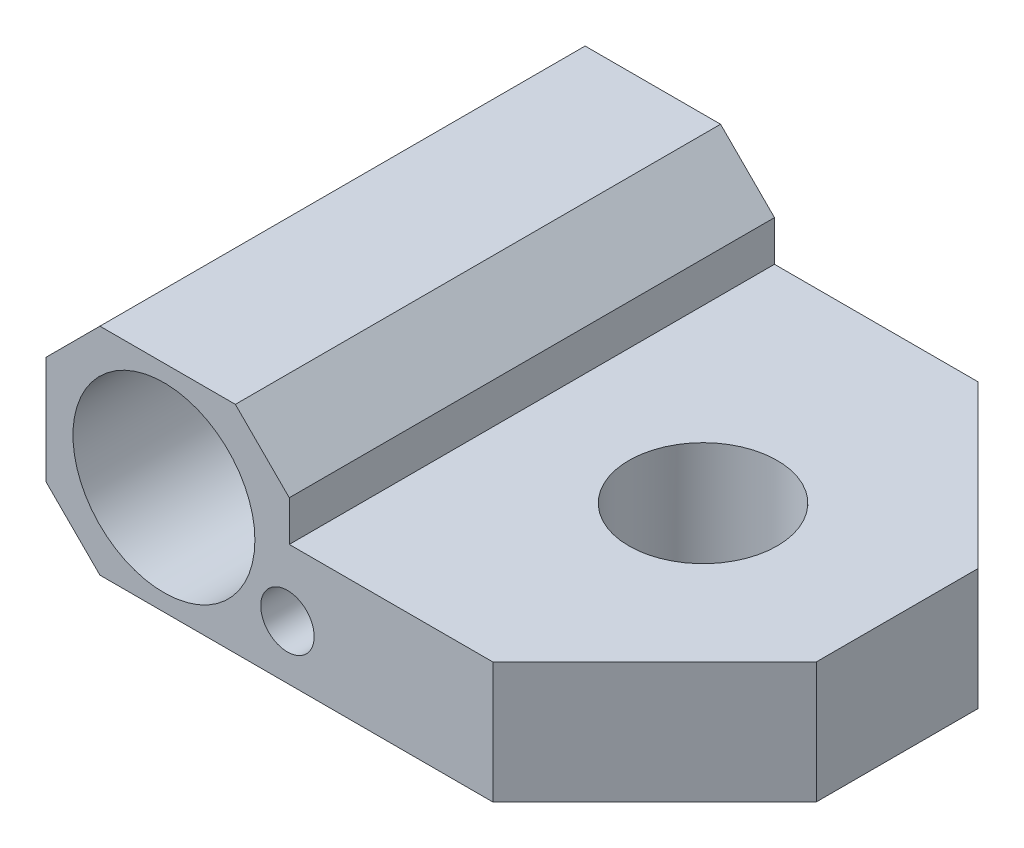
ISO-10303-21;
HEADER;
FILE_DESCRIPTION(('STEP AP214'),'2;1');
FILE_NAME('part.step','',(''),(''),'','','');
FILE_SCHEMA(('AUTOMOTIVE_DESIGN { 1 0 10303 214 1 1 1 1 }'));
ENDSEC;
DATA;
#1=APPLICATION_CONTEXT('core data for automotive mechanical design processes');
#2=APPLICATION_PROTOCOL_DEFINITION('international standard','automotive_design',2000,#1);
#3=PRODUCT_CONTEXT('',#1,'mechanical');
#4=PRODUCT('Part','Part','',(#3));
#5=PRODUCT_RELATED_PRODUCT_CATEGORY('part','',(#4));
#6=PRODUCT_DEFINITION_FORMATION('','',#4);
#7=PRODUCT_DEFINITION_CONTEXT('part definition',#1,'design');
#8=PRODUCT_DEFINITION('design','',#6,#7);
#9=PRODUCT_DEFINITION_SHAPE('','',#8);
#10=(LENGTH_UNIT() NAMED_UNIT(*) SI_UNIT(.MILLI.,.METRE.));
#11=(NAMED_UNIT(*) PLANE_ANGLE_UNIT() SI_UNIT($,.RADIAN.));
#12=(NAMED_UNIT(*) SI_UNIT($,.STERADIAN.) SOLID_ANGLE_UNIT());
#13=UNCERTAINTY_MEASURE_WITH_UNIT(LENGTH_MEASURE(1.E-05),#10,'distance_accuracy_value','');
#14=(GEOMETRIC_REPRESENTATION_CONTEXT(3) GLOBAL_UNCERTAINTY_ASSIGNED_CONTEXT((#13)) GLOBAL_UNIT_ASSIGNED_CONTEXT((#10,
#11,#12)) REPRESENTATION_CONTEXT('',''));
#15=CARTESIAN_POINT('',(0.,0.,0.));
#16=DIRECTION('',(0.,0.,1.));
#17=DIRECTION('',(1.,0.,0.));
#18=AXIS2_PLACEMENT_3D('',#15,#16,#17);
#19=CARTESIAN_POINT('',(-15.375,-4.,-9.));
#20=DIRECTION('',(-1.,0.,0.));
#21=DIRECTION('',(0.,0.,1.));
#22=AXIS2_PLACEMENT_3D('',#19,#20,#21);
#23=PLANE('',#22);
#24=DIRECTION('',(0.,1.,0.));
#25=VECTOR('',#24,1.);
#26=CARTESIAN_POINT('',(-15.375,-4.,-9.));
#27=LINE('',#26,#25);
#28=CARTESIAN_POINT('',(-15.375,-2.,-9.));
#29=VERTEX_POINT('',#28);
#30=CARTESIAN_POINT('',(-15.375,1.99999999999999,-9.));
#31=VERTEX_POINT('',#30);
#32=EDGE_CURVE('E151',#29,#31,#27,.T.);
#33=ORIENTED_EDGE('',*,*,#32,.F.);
#34=DIRECTION('',(0.,0.,1.));
#35=VECTOR('',#34,1.);
#36=CARTESIAN_POINT('',(-15.375,-2.,9.));
#37=LINE('',#36,#35);
#38=CARTESIAN_POINT('',(-15.375,-2.,9.));
#39=VERTEX_POINT('',#38);
#40=EDGE_CURVE('E161',#29,#39,#37,.T.);
#41=ORIENTED_EDGE('',*,*,#40,.T.);
#42=DIRECTION('',(0.,1.,0.));
#43=VECTOR('',#42,1.);
#44=CARTESIAN_POINT('',(-15.375,-4.,9.));
#45=LINE('',#44,#43);
#46=CARTESIAN_POINT('',(-15.375,1.99999999999999,9.));
#47=VERTEX_POINT('',#46);
#48=EDGE_CURVE('E145',#39,#47,#45,.T.);
#49=ORIENTED_EDGE('',*,*,#48,.T.);
#50=DIRECTION('',(0.,0.,-1.));
#51=VECTOR('',#50,1.);
#52=CARTESIAN_POINT('',(-15.375,1.99999999999999,-9.));
#53=LINE('',#52,#51);
#54=EDGE_CURVE('E153',#47,#31,#53,.T.);
#55=ORIENTED_EDGE('',*,*,#54,.T.);
#56=EDGE_LOOP('',(#33,#41,#49,#55));
#57=FACE_BOUND('',#56,.T.);
#58=ADVANCED_FACE('F32',(#57),#23,.T.);
#59=CARTESIAN_POINT('',(-15.375,-4.,-9.));
#60=DIRECTION('',(0.,0.,-1.));
#61=DIRECTION('',(-1.,0.,0.));
#62=AXIS2_PLACEMENT_3D('',#59,#60,#61);
#63=PLANE('',#62);
#64=DIRECTION('',(-1.,0.,0.));
#65=VECTOR('',#64,1.);
#66=CARTESIAN_POINT('',(-15.375,-4.,-9.));
#67=LINE('',#66,#65);
#68=CARTESIAN_POINT('',(1.2,-4.,-9.));
#69=VERTEX_POINT('',#68);
#70=CARTESIAN_POINT('',(-13.375,-4.,-9.));
#71=VERTEX_POINT('',#70);
#72=EDGE_CURVE('E141',#69,#71,#67,.T.);
#73=ORIENTED_EDGE('',*,*,#72,.T.);
#74=DIRECTION('',(-0.707106781186549,0.707106781186546,0.));
#75=VECTOR('',#74,1.);
#76=CARTESIAN_POINT('',(-14.375,-3.,-9.));
#77=LINE('',#76,#75);
#78=EDGE_CURVE('E174',#71,#29,#77,.T.);
#79=ORIENTED_EDGE('',*,*,#78,.T.);
#80=ORIENTED_EDGE('',*,*,#32,.T.);
#81=DIRECTION('',(-0.707106781186546,-0.707106781186549,0.));
#82=VECTOR('',#81,1.);
#83=CARTESIAN_POINT('',(-18.375,-1.00000000000002,-9.));
#84=LINE('',#83,#82);
#85=CARTESIAN_POINT('',(-13.375,4.,-9.));
#86=VERTEX_POINT('',#85);
#87=EDGE_CURVE('E53',#31,#86,#84,.F.);
#88=ORIENTED_EDGE('',*,*,#87,.T.);
#89=DIRECTION('',(-1.,0.,0.));
#90=VECTOR('',#89,1.);
#91=CARTESIAN_POINT('',(-15.375,4.,-9.));
#92=LINE('',#91,#90);
#93=CARTESIAN_POINT('',(-8.35000000000001,4.,-9.));
#94=VERTEX_POINT('',#93);
#95=EDGE_CURVE('E185',#94,#86,#92,.T.);
#96=ORIENTED_EDGE('',*,*,#95,.F.);
#97=DIRECTION('',(0.707106781186549,-0.707106781186546,0.));
#98=VECTOR('',#97,1.);
#99=CARTESIAN_POINT('',(-7.86250000000002,3.51250000000001,-9.));
#100=LINE('',#99,#98);
#101=CARTESIAN_POINT('',(-6.35,2.,-9.));
#102=VERTEX_POINT('',#101);
#103=EDGE_CURVE('E47',#94,#102,#100,.T.);
#104=ORIENTED_EDGE('',*,*,#103,.T.);
#105=DIRECTION('',(0.,-1.,0.));
#106=VECTOR('',#105,1.);
#107=CARTESIAN_POINT('',(-6.35,4.,-9.));
#108=LINE('',#107,#106);
#109=CARTESIAN_POINT('',(-6.35,0.499999999999998,-9.));
#110=VERTEX_POINT('',#109);
#111=EDGE_CURVE('E253',#102,#110,#108,.T.);
#112=ORIENTED_EDGE('',*,*,#111,.T.);
#113=DIRECTION('',(1.,0.,0.));
#114=VECTOR('',#113,1.);
#115=CARTESIAN_POINT('',(7.2,0.5,-9.));
#116=LINE('',#115,#114);
#117=CARTESIAN_POINT('',(1.2,0.499999999999999,-9.));
#118=VERTEX_POINT('',#117);
#119=EDGE_CURVE('E256',#110,#118,#116,.T.);
#120=ORIENTED_EDGE('',*,*,#119,.T.);
#121=DIRECTION('',(0.,1.,0.));
#122=VECTOR('',#121,1.);
#123=CARTESIAN_POINT('',(1.2,-4.,-9.));
#124=LINE('',#123,#122);
#125=EDGE_CURVE('E387',#69,#118,#124,.T.);
#126=ORIENTED_EDGE('',*,*,#125,.F.);
#127=EDGE_LOOP('',(#73,#79,#80,#88,#96,#104,#112,#120,#126));
#128=FACE_BOUND('',#127,.T.);
#129=CARTESIAN_POINT('',(-6.41742430504416,-2.,-9.));
#130=DIRECTION('',(0.,0.,1.));
#131=DIRECTION('',(1.,0.,0.));
#132=AXIS2_PLACEMENT_3D('',#129,#130,#131);
#133=CIRCLE('',#132,0.9905);
#134=CARTESIAN_POINT('',(-5.42692430504416,-2.,-9.));
#135=VERTEX_POINT('',#134);
#136=EDGE_CURVE('E264',#135,#135,#133,.T.);
#137=ORIENTED_EDGE('',*,*,#136,.T.);
#138=EDGE_LOOP('',(#137));
#139=FACE_BOUND('',#138,.T.);
#140=CARTESIAN_POINT('',(-11.,0.,-9.));
#141=DIRECTION('',(0.,0.,1.));
#142=DIRECTION('',(1.,0.,0.));
#143=AXIS2_PLACEMENT_3D('',#140,#141,#142);
#144=CIRCLE('',#143,3.375);
#145=CARTESIAN_POINT('',(-7.625,0.,-9.));
#146=VERTEX_POINT('',#145);
#147=EDGE_CURVE('E192',#146,#146,#144,.T.);
#148=ORIENTED_EDGE('',*,*,#147,.T.);
#149=EDGE_LOOP('',(#148));
#150=FACE_BOUND('',#149,.T.);
#151=ADVANCED_FACE('F215',(#128,#139,#150),#63,.T.);
#152=CARTESIAN_POINT('',(7.2,-4.,-9.));
#153=DIRECTION('',(1.,0.,0.));
#154=DIRECTION('',(0.,0.,-1.));
#155=AXIS2_PLACEMENT_3D('',#152,#153,#154);
#156=PLANE('',#155);
#157=DIRECTION('',(0.,1.,0.));
#158=VECTOR('',#157,1.);
#159=CARTESIAN_POINT('',(7.2,-4.,3.));
#160=LINE('',#159,#158);
#161=CARTESIAN_POINT('',(7.2,-4.,3.));
#162=VERTEX_POINT('',#161);
#163=CARTESIAN_POINT('',(7.2,0.5,3.));
#164=VERTEX_POINT('',#163);
#165=EDGE_CURVE('E119',#162,#164,#160,.T.);
#166=ORIENTED_EDGE('',*,*,#165,.F.);
#167=DIRECTION('',(0.,0.,-1.));
#168=VECTOR('',#167,1.);
#169=CARTESIAN_POINT('',(7.2,-4.,-9.));
#170=LINE('',#169,#168);
#171=CARTESIAN_POINT('',(7.2,-4.,-3.));
#172=VERTEX_POINT('',#171);
#173=EDGE_CURVE('E132',#162,#172,#170,.T.);
#174=ORIENTED_EDGE('',*,*,#173,.T.);
#175=DIRECTION('',(0.,1.,0.));
#176=VECTOR('',#175,1.);
#177=CARTESIAN_POINT('',(7.2,-4.,-3.));
#178=LINE('',#177,#176);
#179=CARTESIAN_POINT('',(7.2,0.499999999999999,-3.));
#180=VERTEX_POINT('',#179);
#181=EDGE_CURVE('E258',#172,#180,#178,.T.);
#182=ORIENTED_EDGE('',*,*,#181,.T.);
#183=DIRECTION('',(0.,0.,1.));
#184=VECTOR('',#183,1.);
#185=CARTESIAN_POINT('',(7.2,0.5,-9.));
#186=LINE('',#185,#184);
#187=EDGE_CURVE('E135',#180,#164,#186,.T.);
#188=ORIENTED_EDGE('',*,*,#187,.T.);
#189=EDGE_LOOP('',(#166,#174,#182,#188));
#190=FACE_BOUND('',#189,.T.);
#191=ADVANCED_FACE('F130',(#190),#156,.T.);
#192=CARTESIAN_POINT('',(-15.375,-4.,9.));
#193=DIRECTION('',(0.,0.,1.));
#194=DIRECTION('',(1.,0.,0.));
#195=AXIS2_PLACEMENT_3D('',#192,#193,#194);
#196=PLANE('',#195);
#197=ORIENTED_EDGE('',*,*,#48,.F.);
#198=DIRECTION('',(0.707106781186549,-0.707106781186546,0.));
#199=VECTOR('',#198,1.);
#200=CARTESIAN_POINT('',(-14.375,-3.,9.));
#201=LINE('',#200,#199);
#202=CARTESIAN_POINT('',(-13.375,-4.,9.));
#203=VERTEX_POINT('',#202);
#204=EDGE_CURVE('E168',#39,#203,#201,.T.);
#205=ORIENTED_EDGE('',*,*,#204,.T.);
#206=DIRECTION('',(1.,0.,0.));
#207=VECTOR('',#206,1.);
#208=CARTESIAN_POINT('',(-15.375,-4.,9.));
#209=LINE('',#208,#207);
#210=CARTESIAN_POINT('',(1.2,-4.,9.));
#211=VERTEX_POINT('',#210);
#212=EDGE_CURVE('E142',#203,#211,#209,.T.);
#213=ORIENTED_EDGE('',*,*,#212,.T.);
#214=DIRECTION('',(0.,1.,0.));
#215=VECTOR('',#214,1.);
#216=CARTESIAN_POINT('',(1.2,-4.,9.));
#217=LINE('',#216,#215);
#218=CARTESIAN_POINT('',(1.2,0.499999999999999,9.));
#219=VERTEX_POINT('',#218);
#220=EDGE_CURVE('E122',#211,#219,#217,.T.);
#221=ORIENTED_EDGE('',*,*,#220,.T.);
#222=DIRECTION('',(1.,0.,0.));
#223=VECTOR('',#222,1.);
#224=CARTESIAN_POINT('',(7.2,0.5,9.));
#225=LINE('',#224,#223);
#226=CARTESIAN_POINT('',(-6.35,0.499999999999998,9.));
#227=VERTEX_POINT('',#226);
#228=EDGE_CURVE('E243',#227,#219,#225,.T.);
#229=ORIENTED_EDGE('',*,*,#228,.F.);
#230=DIRECTION('',(0.,-1.,0.));
#231=VECTOR('',#230,1.);
#232=CARTESIAN_POINT('',(-6.35,4.,9.));
#233=LINE('',#232,#231);
#234=CARTESIAN_POINT('',(-6.35,2.,9.));
#235=VERTEX_POINT('',#234);
#236=EDGE_CURVE('E254',#235,#227,#233,.T.);
#237=ORIENTED_EDGE('',*,*,#236,.F.);
#238=DIRECTION('',(-0.707106781186549,0.707106781186546,0.));
#239=VECTOR('',#238,1.);
#240=CARTESIAN_POINT('',(-7.86250000000002,3.51250000000001,9.));
#241=LINE('',#240,#239);
#242=CARTESIAN_POINT('',(-8.35000000000001,4.,9.));
#243=VERTEX_POINT('',#242);
#244=EDGE_CURVE('E164',#235,#243,#241,.T.);
#245=ORIENTED_EDGE('',*,*,#244,.T.);
#246=DIRECTION('',(1.,0.,0.));
#247=VECTOR('',#246,1.);
#248=CARTESIAN_POINT('',(-15.375,4.,9.));
#249=LINE('',#248,#247);
#250=CARTESIAN_POINT('',(-13.375,4.,9.));
#251=VERTEX_POINT('',#250);
#252=EDGE_CURVE('E183',#251,#243,#249,.T.);
#253=ORIENTED_EDGE('',*,*,#252,.F.);
#254=DIRECTION('',(0.707106781186546,0.707106781186549,0.));
#255=VECTOR('',#254,1.);
#256=CARTESIAN_POINT('',(-18.375,-1.00000000000002,9.));
#257=LINE('',#256,#255);
#258=EDGE_CURVE('E166',#251,#47,#257,.F.);
#259=ORIENTED_EDGE('',*,*,#258,.T.);
#260=EDGE_LOOP('',(#197,#205,#213,#221,#229,#237,#245,#253,#259));
#261=FACE_BOUND('',#260,.T.);
#262=CARTESIAN_POINT('',(-6.41742430504416,-2.,9.));
#263=DIRECTION('',(0.,0.,1.));
#264=DIRECTION('',(1.,0.,0.));
#265=AXIS2_PLACEMENT_3D('',#262,#263,#264);
#266=CIRCLE('',#265,0.9905);
#267=CARTESIAN_POINT('',(-5.42692430504416,-2.,9.));
#268=VERTEX_POINT('',#267);
#269=EDGE_CURVE('E159',#268,#268,#266,.T.);
#270=ORIENTED_EDGE('',*,*,#269,.F.);
#271=EDGE_LOOP('',(#270));
#272=FACE_BOUND('',#271,.T.);
#273=CARTESIAN_POINT('',(-11.,0.,9.));
#274=DIRECTION('',(0.,0.,1.));
#275=DIRECTION('',(1.,0.,0.));
#276=AXIS2_PLACEMENT_3D('',#273,#274,#275);
#277=CIRCLE('',#276,3.375);
#278=CARTESIAN_POINT('',(-7.625,0.,9.));
#279=VERTEX_POINT('',#278);
#280=EDGE_CURVE('E196',#279,#279,#277,.T.);
#281=ORIENTED_EDGE('',*,*,#280,.F.);
#282=EDGE_LOOP('',(#281));
#283=FACE_BOUND('',#282,.T.);
#284=ADVANCED_FACE('F189',(#261,#272,#283),#196,.T.);
#285=CARTESIAN_POINT('',(-15.375,-4.,9.));
#286=DIRECTION('',(0.,1.,0.));
#287=DIRECTION('',(0.,0.,1.));
#288=AXIS2_PLACEMENT_3D('',#285,#286,#287);
#289=PLANE('',#288);
#290=CARTESIAN_POINT('',(0.,-4.,0.));
#291=DIRECTION('',(0.,1.,0.));
#292=DIRECTION('',(0.,0.,1.));
#293=AXIS2_PLACEMENT_3D('',#290,#291,#292);
#294=CIRCLE('',#293,2.75);
#295=CARTESIAN_POINT('',(0.,-4.,2.75));
#296=VERTEX_POINT('',#295);
#297=EDGE_CURVE('E147',#296,#296,#294,.T.);
#298=ORIENTED_EDGE('',*,*,#297,.T.);
#299=EDGE_LOOP('',(#298));
#300=FACE_BOUND('',#299,.T.);
#301=ORIENTED_EDGE('',*,*,#212,.F.);
#302=DIRECTION('',(0.,0.,-1.));
#303=VECTOR('',#302,1.);
#304=CARTESIAN_POINT('',(-13.375,-4.,-9.));
#305=LINE('',#304,#303);
#306=EDGE_CURVE('E170',#203,#71,#305,.T.);
#307=ORIENTED_EDGE('',*,*,#306,.T.);
#308=ORIENTED_EDGE('',*,*,#72,.F.);
#309=DIRECTION('',(0.707106781186547,0.,0.707106781186548));
#310=VECTOR('',#309,1.);
#311=CARTESIAN_POINT('',(1.2,-4.,-9.));
#312=LINE('',#311,#310);
#313=EDGE_CURVE('E140',#69,#172,#312,.T.);
#314=ORIENTED_EDGE('',*,*,#313,.T.);
#315=ORIENTED_EDGE('',*,*,#173,.F.);
#316=DIRECTION('',(-0.707106781186548,0.,0.707106781186548));
#317=VECTOR('',#316,1.);
#318=CARTESIAN_POINT('',(1.2,-4.,9.));
#319=LINE('',#318,#317);
#320=EDGE_CURVE('E116',#162,#211,#319,.T.);
#321=ORIENTED_EDGE('',*,*,#320,.T.);
#322=EDGE_LOOP('',(#301,#307,#308,#314,#315,#321));
#323=FACE_BOUND('',#322,.T.);
#324=ADVANCED_FACE('F138',(#300,#323),#289,.F.);
#325=CARTESIAN_POINT('',(0.,-4.,0.));
#326=DIRECTION('',(0.,1.,0.));
#327=DIRECTION('',(0.,0.,1.));
#328=AXIS2_PLACEMENT_3D('',#325,#326,#327);
#329=CYLINDRICAL_SURFACE('',#328,2.75);
#330=CARTESIAN_POINT('',(0.,0.5,0.));
#331=DIRECTION('',(0.,-1.,0.));
#332=DIRECTION('',(1.,0.,0.));
#333=AXIS2_PLACEMENT_3D('',#330,#331,#332);
#334=CIRCLE('',#333,2.75);
#335=CARTESIAN_POINT('',(2.75,0.5,0.));
#336=VERTEX_POINT('',#335);
#337=EDGE_CURVE('E156',#336,#336,#334,.F.);
#338=ORIENTED_EDGE('',*,*,#337,.T.);
#339=EDGE_LOOP('',(#338));
#340=FACE_BOUND('',#339,.T.);
#341=ORIENTED_EDGE('',*,*,#297,.F.);
#342=EDGE_LOOP('',(#341));
#343=FACE_BOUND('',#342,.T.);
#344=ADVANCED_FACE('F203',(#340,#343),#329,.F.);
#345=CARTESIAN_POINT('',(-15.375,4.,9.));
#346=DIRECTION('',(0.,1.,0.));
#347=DIRECTION('',(0.,0.,1.));
#348=AXIS2_PLACEMENT_3D('',#345,#346,#347);
#349=PLANE('',#348);
#350=ORIENTED_EDGE('',*,*,#95,.T.);
#351=DIRECTION('',(0.,0.,1.));
#352=VECTOR('',#351,1.);
#353=CARTESIAN_POINT('',(-13.375,4.,9.));
#354=LINE('',#353,#352);
#355=EDGE_CURVE('E40',#86,#251,#354,.T.);
#356=ORIENTED_EDGE('',*,*,#355,.T.);
#357=ORIENTED_EDGE('',*,*,#252,.T.);
#358=DIRECTION('',(0.,0.,-1.));
#359=VECTOR('',#358,1.);
#360=CARTESIAN_POINT('',(-8.35000000000001,4.,-9.));
#361=LINE('',#360,#359);
#362=EDGE_CURVE('E176',#243,#94,#361,.T.);
#363=ORIENTED_EDGE('',*,*,#362,.T.);
#364=EDGE_LOOP('',(#350,#356,#357,#363));
#365=FACE_BOUND('',#364,.T.);
#366=ADVANCED_FACE('F182',(#365),#349,.T.);
#367=CARTESIAN_POINT('',(-11.,0.,-9.));
#368=DIRECTION('',(0.,0.,1.));
#369=DIRECTION('',(1.,0.,0.));
#370=AXIS2_PLACEMENT_3D('',#367,#368,#369);
#371=CYLINDRICAL_SURFACE('',#370,3.375);
#372=ORIENTED_EDGE('',*,*,#147,.F.);
#373=EDGE_LOOP('',(#372));
#374=FACE_BOUND('',#373,.T.);
#375=ORIENTED_EDGE('',*,*,#280,.T.);
#376=EDGE_LOOP('',(#375));
#377=FACE_BOUND('',#376,.T.);
#378=ADVANCED_FACE('F211',(#374,#377),#371,.F.);
#379=CARTESIAN_POINT('',(-6.41742430504416,-2.,-9.));
#380=DIRECTION('',(0.,0.,1.));
#381=DIRECTION('',(1.,0.,0.));
#382=AXIS2_PLACEMENT_3D('',#379,#380,#381);
#383=CYLINDRICAL_SURFACE('',#382,0.9905);
#384=ORIENTED_EDGE('',*,*,#136,.F.);
#385=EDGE_LOOP('',(#384));
#386=FACE_BOUND('',#385,.T.);
#387=ORIENTED_EDGE('',*,*,#269,.T.);
#388=EDGE_LOOP('',(#387));
#389=FACE_BOUND('',#388,.T.);
#390=ADVANCED_FACE('F270',(#386,#389),#383,.F.);
#391=CARTESIAN_POINT('',(7.2,0.5,-9.));
#392=DIRECTION('',(0.,-1.,0.));
#393=DIRECTION('',(1.,0.,0.));
#394=AXIS2_PLACEMENT_3D('',#391,#392,#393);
#395=PLANE('',#394);
#396=ORIENTED_EDGE('',*,*,#228,.T.);
#397=DIRECTION('',(-0.707106781186548,0.,0.707106781186548));
#398=VECTOR('',#397,1.);
#399=CARTESIAN_POINT('',(1.2,0.499999999999999,9.));
#400=LINE('',#399,#398);
#401=EDGE_CURVE('E126',#164,#219,#400,.T.);
#402=ORIENTED_EDGE('',*,*,#401,.F.);
#403=ORIENTED_EDGE('',*,*,#187,.F.);
#404=DIRECTION('',(0.707106781186547,0.,0.707106781186548));
#405=VECTOR('',#404,1.);
#406=CARTESIAN_POINT('',(1.2,0.499999999999999,-9.));
#407=LINE('',#406,#405);
#408=EDGE_CURVE('E244',#118,#180,#407,.T.);
#409=ORIENTED_EDGE('',*,*,#408,.F.);
#410=ORIENTED_EDGE('',*,*,#119,.F.);
#411=DIRECTION('',(0.,0.,1.));
#412=VECTOR('',#411,1.);
#413=CARTESIAN_POINT('',(-6.35,0.499999999999998,-9.));
#414=LINE('',#413,#412);
#415=EDGE_CURVE('E252',#110,#227,#414,.T.);
#416=ORIENTED_EDGE('',*,*,#415,.T.);
#417=EDGE_LOOP('',(#396,#402,#403,#409,#410,#416));
#418=FACE_BOUND('',#417,.T.);
#419=ORIENTED_EDGE('',*,*,#337,.F.);
#420=EDGE_LOOP('',(#419));
#421=FACE_BOUND('',#420,.T.);
#422=ADVANCED_FACE('F248',(#418,#421),#395,.F.);
#423=CARTESIAN_POINT('',(-6.35,4.,-9.));
#424=DIRECTION('',(-1.,0.,0.));
#425=DIRECTION('',(0.,0.,1.));
#426=AXIS2_PLACEMENT_3D('',#423,#424,#425);
#427=PLANE('',#426);
#428=ORIENTED_EDGE('',*,*,#111,.F.);
#429=DIRECTION('',(0.,0.,1.));
#430=VECTOR('',#429,1.);
#431=CARTESIAN_POINT('',(-6.35,1.99999999999999,9.));
#432=LINE('',#431,#430);
#433=EDGE_CURVE('E11',#102,#235,#432,.T.);
#434=ORIENTED_EDGE('',*,*,#433,.T.);
#435=ORIENTED_EDGE('',*,*,#236,.T.);
#436=ORIENTED_EDGE('',*,*,#415,.F.);
#437=EDGE_LOOP('',(#428,#434,#435,#436));
#438=FACE_BOUND('',#437,.T.);
#439=ADVANCED_FACE('F286',(#438),#427,.F.);
#440=CARTESIAN_POINT('',(1.2,-4.,-9.));
#441=DIRECTION('',(-0.707106781186548,0.,0.707106781186547));
#442=DIRECTION('',(0.707106781186547,0.,0.707106781186548));
#443=AXIS2_PLACEMENT_3D('',#440,#441,#442);
#444=PLANE('',#443);
#445=ORIENTED_EDGE('',*,*,#408,.T.);
#446=ORIENTED_EDGE('',*,*,#181,.F.);
#447=ORIENTED_EDGE('',*,*,#313,.F.);
#448=ORIENTED_EDGE('',*,*,#125,.T.);
#449=EDGE_LOOP('',(#445,#446,#447,#448));
#450=FACE_BOUND('',#449,.T.);
#451=ADVANCED_FACE('F289',(#450),#444,.F.);
#452=CARTESIAN_POINT('',(1.2,-4.,9.));
#453=DIRECTION('',(-0.707106781186547,0.,-0.707106781186547));
#454=DIRECTION('',(-0.707106781186548,0.,0.707106781186548));
#455=AXIS2_PLACEMENT_3D('',#452,#453,#454);
#456=PLANE('',#455);
#457=ORIENTED_EDGE('',*,*,#401,.T.);
#458=ORIENTED_EDGE('',*,*,#220,.F.);
#459=ORIENTED_EDGE('',*,*,#320,.F.);
#460=ORIENTED_EDGE('',*,*,#165,.T.);
#461=EDGE_LOOP('',(#457,#458,#459,#460));
#462=FACE_BOUND('',#461,.T.);
#463=ADVANCED_FACE('F118',(#462),#456,.F.);
#464=CARTESIAN_POINT('',(-15.375,-2.,-9.));
#465=DIRECTION('',(-0.707106781186546,-0.707106781186549,0.));
#466=DIRECTION('',(0.707106781186549,-0.707106781186546,0.));
#467=AXIS2_PLACEMENT_3D('',#464,#465,#466);
#468=PLANE('',#467);
#469=ORIENTED_EDGE('',*,*,#78,.F.);
#470=ORIENTED_EDGE('',*,*,#306,.F.);
#471=ORIENTED_EDGE('',*,*,#204,.F.);
#472=ORIENTED_EDGE('',*,*,#40,.F.);
#473=EDGE_LOOP('',(#469,#470,#471,#472));
#474=FACE_BOUND('',#473,.T.);
#475=ADVANCED_FACE('F226',(#474),#468,.T.);
#476=CARTESIAN_POINT('',(-13.375,4.,9.));
#477=DIRECTION('',(0.707106781186549,-0.707106781186546,0.));
#478=DIRECTION('',(0.707106781186546,0.707106781186549,0.));
#479=AXIS2_PLACEMENT_3D('',#476,#477,#478);
#480=PLANE('',#479);
#481=ORIENTED_EDGE('',*,*,#87,.F.);
#482=ORIENTED_EDGE('',*,*,#54,.F.);
#483=ORIENTED_EDGE('',*,*,#258,.F.);
#484=ORIENTED_EDGE('',*,*,#355,.F.);
#485=EDGE_LOOP('',(#481,#482,#483,#484));
#486=FACE_BOUND('',#485,.T.);
#487=ADVANCED_FACE('F228',(#486),#480,.F.);
#488=CARTESIAN_POINT('',(-6.35,1.99999999999999,-9.));
#489=DIRECTION('',(0.707106781186546,0.707106781186549,0.));
#490=DIRECTION('',(-0.707106781186549,0.707106781186546,0.));
#491=AXIS2_PLACEMENT_3D('',#488,#489,#490);
#492=PLANE('',#491);
#493=ORIENTED_EDGE('',*,*,#103,.F.);
#494=ORIENTED_EDGE('',*,*,#362,.F.);
#495=ORIENTED_EDGE('',*,*,#244,.F.);
#496=ORIENTED_EDGE('',*,*,#433,.F.);
#497=EDGE_LOOP('',(#493,#494,#495,#496));
#498=FACE_BOUND('',#497,.T.);
#499=ADVANCED_FACE('F34',(#498),#492,.T.);
#500=CLOSED_SHELL('',(#58,#151,#191,#284,#324,#344,#366,#378,#390,#422,#439,#451,#463,#475,#487,#499));
#501=MANIFOLD_SOLID_BREP('B2',#500);
#502=ADVANCED_BREP_SHAPE_REPRESENTATION('',(#18,#501),#14);
#503=SHAPE_DEFINITION_REPRESENTATION(#9,#502);
ENDSEC;
END-ISO-10303-21;
